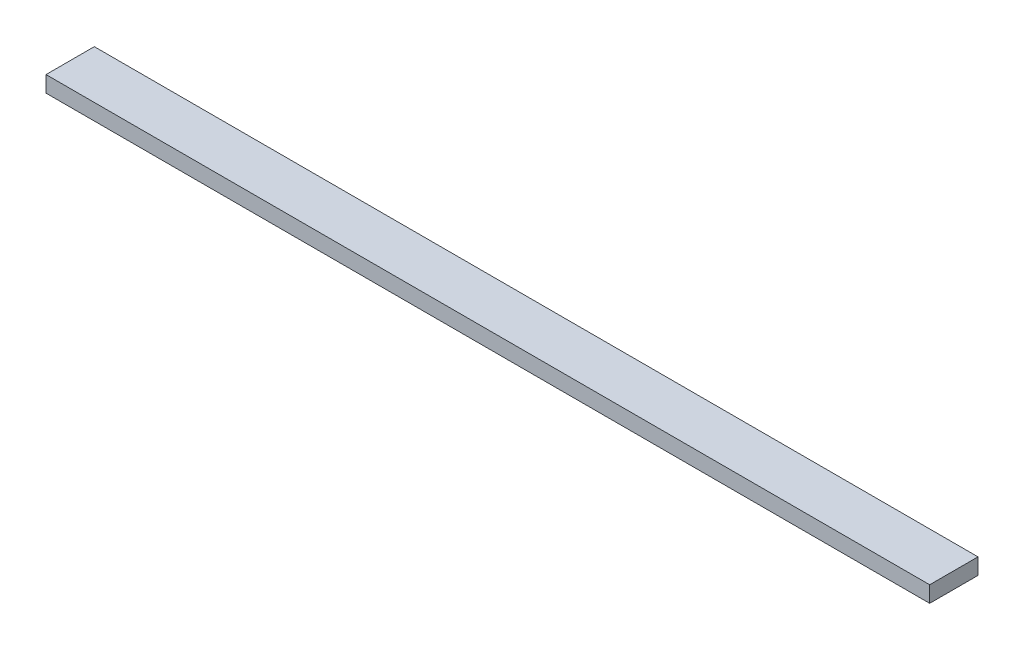
ISO-10303-21;
HEADER;
FILE_DESCRIPTION(('STEP AP214'),'2;1');
FILE_NAME('part.step','',(''),(''),'','','');
FILE_SCHEMA(('AUTOMOTIVE_DESIGN { 1 0 10303 214 1 1 1 1 }'));
ENDSEC;
DATA;
#1=APPLICATION_CONTEXT('core data for automotive mechanical design processes');
#2=APPLICATION_PROTOCOL_DEFINITION('international standard','automotive_design',2000,#1);
#3=PRODUCT_CONTEXT('',#1,'mechanical');
#4=PRODUCT('Part','Part','',(#3));
#5=PRODUCT_RELATED_PRODUCT_CATEGORY('part','',(#4));
#6=PRODUCT_DEFINITION_FORMATION('','',#4);
#7=PRODUCT_DEFINITION_CONTEXT('part definition',#1,'design');
#8=PRODUCT_DEFINITION('design','',#6,#7);
#9=PRODUCT_DEFINITION_SHAPE('','',#8);
#10=(LENGTH_UNIT() NAMED_UNIT(*) SI_UNIT(.MILLI.,.METRE.));
#11=(NAMED_UNIT(*) PLANE_ANGLE_UNIT() SI_UNIT($,.RADIAN.));
#12=(NAMED_UNIT(*) SI_UNIT($,.STERADIAN.) SOLID_ANGLE_UNIT());
#13=UNCERTAINTY_MEASURE_WITH_UNIT(LENGTH_MEASURE(1.E-05),#10,'distance_accuracy_value','');
#14=(GEOMETRIC_REPRESENTATION_CONTEXT(3) GLOBAL_UNCERTAINTY_ASSIGNED_CONTEXT((#13)) GLOBAL_UNIT_ASSIGNED_CONTEXT((#10,
#11,#12)) REPRESENTATION_CONTEXT('',''));
#15=CARTESIAN_POINT('',(0.,0.,0.));
#16=DIRECTION('',(0.,0.,1.));
#17=DIRECTION('',(1.,0.,0.));
#18=AXIS2_PLACEMENT_3D('',#15,#16,#17);
#19=CARTESIAN_POINT('',(-274.265,10.,-15.));
#20=DIRECTION('',(1.,0.,0.));
#21=DIRECTION('',(0.,0.,-1.));
#22=AXIS2_PLACEMENT_3D('',#19,#20,#21);
#23=PLANE('',#22);
#24=DIRECTION('',(0.,0.,1.));
#25=VECTOR('',#24,1.);
#26=CARTESIAN_POINT('',(-274.265,0.,-15.));
#27=LINE('',#26,#25);
#28=CARTESIAN_POINT('',(-274.265,0.,-15.));
#29=VERTEX_POINT('',#28);
#30=CARTESIAN_POINT('',(-274.265,0.,15.));
#31=VERTEX_POINT('',#30);
#32=EDGE_CURVE('E97',#29,#31,#27,.T.);
#33=ORIENTED_EDGE('',*,*,#32,.T.);
#34=DIRECTION('',(0.,-1.,0.));
#35=VECTOR('',#34,1.);
#36=CARTESIAN_POINT('',(-274.265,10.,15.));
#37=LINE('',#36,#35);
#38=CARTESIAN_POINT('',(-274.265,10.,15.));
#39=VERTEX_POINT('',#38);
#40=EDGE_CURVE('E11',#39,#31,#37,.T.);
#41=ORIENTED_EDGE('',*,*,#40,.F.);
#42=DIRECTION('',(0.,0.,1.));
#43=VECTOR('',#42,1.);
#44=CARTESIAN_POINT('',(-274.265,10.,-15.));
#45=LINE('',#44,#43);
#46=CARTESIAN_POINT('',(-274.265,10.,-15.));
#47=VERTEX_POINT('',#46);
#48=EDGE_CURVE('E85',#47,#39,#45,.T.);
#49=ORIENTED_EDGE('',*,*,#48,.F.);
#50=DIRECTION('',(0.,-1.,0.));
#51=VECTOR('',#50,1.);
#52=CARTESIAN_POINT('',(-274.265,10.,-15.));
#53=LINE('',#52,#51);
#54=EDGE_CURVE('E93',#47,#29,#53,.T.);
#55=ORIENTED_EDGE('',*,*,#54,.T.);
#56=EDGE_LOOP('',(#33,#41,#49,#55));
#57=FACE_BOUND('',#56,.T.);
#58=ADVANCED_FACE('F34',(#57),#23,.F.);
#59=CARTESIAN_POINT('',(-274.265,10.,15.));
#60=DIRECTION('',(0.,0.,-1.));
#61=DIRECTION('',(-1.,0.,0.));
#62=AXIS2_PLACEMENT_3D('',#59,#60,#61);
#63=PLANE('',#62);
#64=DIRECTION('',(1.,0.,0.));
#65=VECTOR('',#64,1.);
#66=CARTESIAN_POINT('',(-274.265,0.,15.));
#67=LINE('',#66,#65);
#68=CARTESIAN_POINT('',(274.265,0.,15.));
#69=VERTEX_POINT('',#68);
#70=EDGE_CURVE('E89',#31,#69,#67,.T.);
#71=ORIENTED_EDGE('',*,*,#70,.T.);
#72=DIRECTION('',(0.,-1.,0.));
#73=VECTOR('',#72,1.);
#74=CARTESIAN_POINT('',(274.265,10.,15.));
#75=LINE('',#74,#73);
#76=CARTESIAN_POINT('',(274.265,10.,15.));
#77=VERTEX_POINT('',#76);
#78=EDGE_CURVE('E42',#77,#69,#75,.T.);
#79=ORIENTED_EDGE('',*,*,#78,.F.);
#80=DIRECTION('',(1.,0.,0.));
#81=VECTOR('',#80,1.);
#82=CARTESIAN_POINT('',(-274.265,10.,15.));
#83=LINE('',#82,#81);
#84=EDGE_CURVE('E80',#39,#77,#83,.T.);
#85=ORIENTED_EDGE('',*,*,#84,.F.);
#86=ORIENTED_EDGE('',*,*,#40,.T.);
#87=EDGE_LOOP('',(#71,#79,#85,#86));
#88=FACE_BOUND('',#87,.T.);
#89=ADVANCED_FACE('F88',(#88),#63,.F.);
#90=CARTESIAN_POINT('',(274.265,10.,-15.));
#91=DIRECTION('',(-1.,0.,0.));
#92=DIRECTION('',(0.,0.,1.));
#93=AXIS2_PLACEMENT_3D('',#90,#91,#92);
#94=PLANE('',#93);
#95=DIRECTION('',(0.,0.,-1.));
#96=VECTOR('',#95,1.);
#97=CARTESIAN_POINT('',(274.265,0.,-15.));
#98=LINE('',#97,#96);
#99=CARTESIAN_POINT('',(274.265,0.,-15.));
#100=VERTEX_POINT('',#99);
#101=EDGE_CURVE('E67',#69,#100,#98,.T.);
#102=ORIENTED_EDGE('',*,*,#101,.T.);
#103=DIRECTION('',(0.,-1.,0.));
#104=VECTOR('',#103,1.);
#105=CARTESIAN_POINT('',(274.265,10.,-15.));
#106=LINE('',#105,#104);
#107=CARTESIAN_POINT('',(274.265,10.,-15.));
#108=VERTEX_POINT('',#107);
#109=EDGE_CURVE('E90',#108,#100,#106,.T.);
#110=ORIENTED_EDGE('',*,*,#109,.F.);
#111=DIRECTION('',(0.,0.,-1.));
#112=VECTOR('',#111,1.);
#113=CARTESIAN_POINT('',(274.265,10.,-15.));
#114=LINE('',#113,#112);
#115=EDGE_CURVE('E83',#77,#108,#114,.T.);
#116=ORIENTED_EDGE('',*,*,#115,.F.);
#117=ORIENTED_EDGE('',*,*,#78,.T.);
#118=EDGE_LOOP('',(#102,#110,#116,#117));
#119=FACE_BOUND('',#118,.T.);
#120=ADVANCED_FACE('F91',(#119),#94,.F.);
#121=CARTESIAN_POINT('',(-274.265,10.,-15.));
#122=DIRECTION('',(0.,0.,1.));
#123=DIRECTION('',(1.,0.,0.));
#124=AXIS2_PLACEMENT_3D('',#121,#122,#123);
#125=PLANE('',#124);
#126=DIRECTION('',(-1.,0.,0.));
#127=VECTOR('',#126,1.);
#128=CARTESIAN_POINT('',(-274.265,0.,-15.));
#129=LINE('',#128,#127);
#130=EDGE_CURVE('E73',#100,#29,#129,.T.);
#131=ORIENTED_EDGE('',*,*,#130,.T.);
#132=ORIENTED_EDGE('',*,*,#54,.F.);
#133=DIRECTION('',(-1.,0.,0.));
#134=VECTOR('',#133,1.);
#135=CARTESIAN_POINT('',(-274.265,10.,-15.));
#136=LINE('',#135,#134);
#137=EDGE_CURVE('E50',#108,#47,#136,.T.);
#138=ORIENTED_EDGE('',*,*,#137,.F.);
#139=ORIENTED_EDGE('',*,*,#109,.T.);
#140=EDGE_LOOP('',(#131,#132,#138,#139));
#141=FACE_BOUND('',#140,.T.);
#142=ADVANCED_FACE('F104',(#141),#125,.F.);
#143=CARTESIAN_POINT('',(0.,10.,0.));
#144=DIRECTION('',(0.,1.,0.));
#145=DIRECTION('',(0.,0.,1.));
#146=AXIS2_PLACEMENT_3D('',#143,#144,#145);
#147=PLANE('',#146);
#148=ORIENTED_EDGE('',*,*,#48,.T.);
#149=ORIENTED_EDGE('',*,*,#84,.T.);
#150=ORIENTED_EDGE('',*,*,#115,.T.);
#151=ORIENTED_EDGE('',*,*,#137,.T.);
#152=EDGE_LOOP('',(#148,#149,#150,#151));
#153=FACE_BOUND('',#152,.T.);
#154=ADVANCED_FACE('F81',(#153),#147,.T.);
#155=CARTESIAN_POINT('',(0.,0.,0.));
#156=DIRECTION('',(0.,1.,0.));
#157=DIRECTION('',(0.,0.,1.));
#158=AXIS2_PLACEMENT_3D('',#155,#156,#157);
#159=PLANE('',#158);
#160=ORIENTED_EDGE('',*,*,#32,.F.);
#161=ORIENTED_EDGE('',*,*,#130,.F.);
#162=ORIENTED_EDGE('',*,*,#101,.F.);
#163=ORIENTED_EDGE('',*,*,#70,.F.);
#164=EDGE_LOOP('',(#160,#161,#162,#163));
#165=FACE_BOUND('',#164,.T.);
#166=ADVANCED_FACE('F107',(#165),#159,.F.);
#167=CLOSED_SHELL('',(#58,#89,#120,#142,#154,#166));
#168=MANIFOLD_SOLID_BREP('B2',#167);
#169=ADVANCED_BREP_SHAPE_REPRESENTATION('',(#18,#168),#14);
#170=SHAPE_DEFINITION_REPRESENTATION(#9,#169);
ENDSEC;
END-ISO-10303-21;
